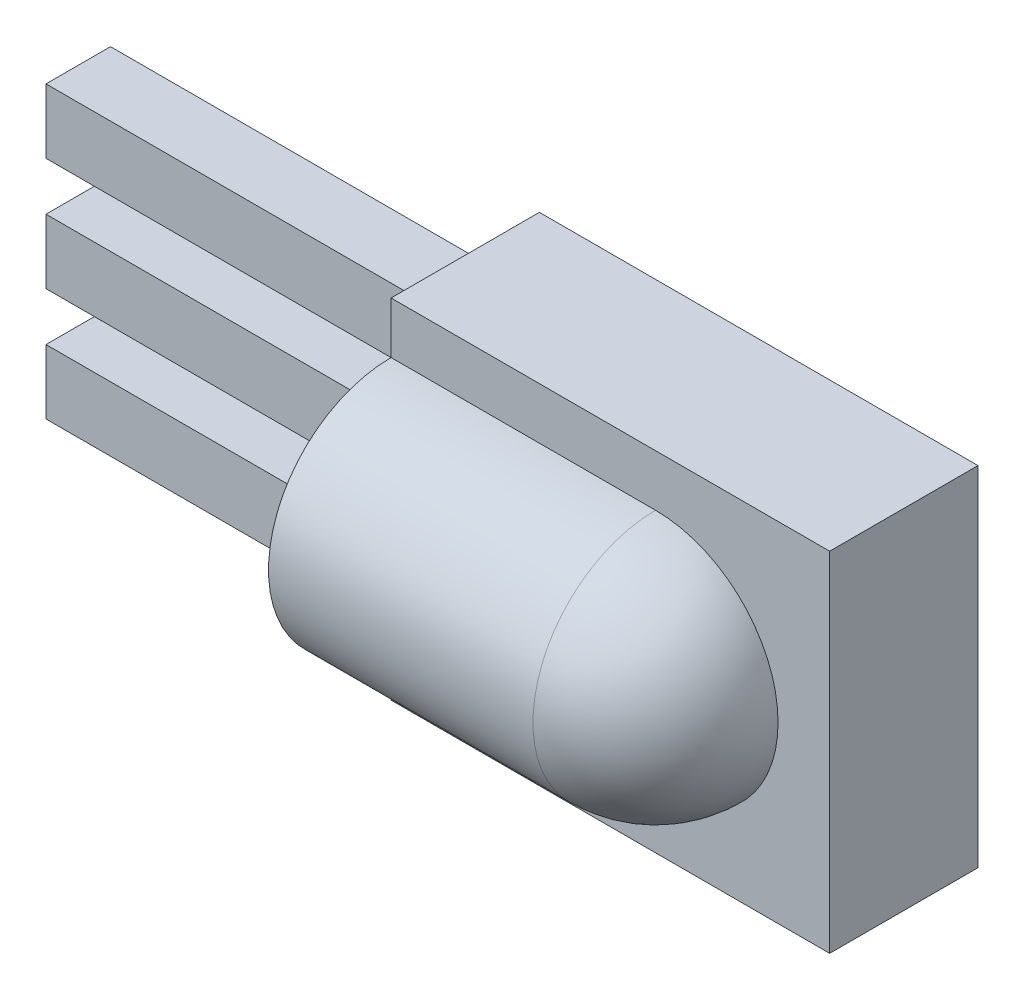
ISO-10303-21;
HEADER;
FILE_DESCRIPTION(('STEP AP214'),'2;1');
FILE_NAME('part.step','',(''),(''),'','','');
FILE_SCHEMA(('AUTOMOTIVE_DESIGN { 1 0 10303 214 1 1 1 1 }'));
ENDSEC;
DATA;
#1=APPLICATION_CONTEXT('core data for automotive mechanical design processes');
#2=APPLICATION_PROTOCOL_DEFINITION('international standard','automotive_design',2000,#1);
#3=PRODUCT_CONTEXT('',#1,'mechanical');
#4=PRODUCT('Part','Part','',(#3));
#5=PRODUCT_RELATED_PRODUCT_CATEGORY('part','',(#4));
#6=PRODUCT_DEFINITION_FORMATION('','',#4);
#7=PRODUCT_DEFINITION_CONTEXT('part definition',#1,'design');
#8=PRODUCT_DEFINITION('design','',#6,#7);
#9=PRODUCT_DEFINITION_SHAPE('','',#8);
#10=(LENGTH_UNIT() NAMED_UNIT(*) SI_UNIT(.MILLI.,.METRE.));
#11=(NAMED_UNIT(*) PLANE_ANGLE_UNIT() SI_UNIT($,.RADIAN.));
#12=(NAMED_UNIT(*) SI_UNIT($,.STERADIAN.) SOLID_ANGLE_UNIT());
#13=UNCERTAINTY_MEASURE_WITH_UNIT(LENGTH_MEASURE(1.E-05),#10,'distance_accuracy_value','');
#14=(GEOMETRIC_REPRESENTATION_CONTEXT(3) GLOBAL_UNCERTAINTY_ASSIGNED_CONTEXT((#13)) GLOBAL_UNIT_ASSIGNED_CONTEXT((#10,
#11,#12)) REPRESENTATION_CONTEXT('',''));
#15=CARTESIAN_POINT('',(0.,0.,0.));
#16=DIRECTION('',(0.,0.,1.));
#17=DIRECTION('',(1.,0.,0.));
#18=AXIS2_PLACEMENT_3D('',#15,#16,#17);
#19=CARTESIAN_POINT('',(0.,0.,2.3));
#20=DIRECTION('',(1.,0.,0.));
#21=DIRECTION('',(0.,0.,-1.));
#22=AXIS2_PLACEMENT_3D('',#19,#20,#21);
#23=PLANE('',#22);
#24=DIRECTION('',(0.,0.,-1.));
#25=VECTOR('',#24,1.);
#26=CARTESIAN_POINT('',(0.,4.95,1.64999999999999));
#27=LINE('',#26,#25);
#28=CARTESIAN_POINT('',(0.,4.95,1.64999999999999));
#29=VERTEX_POINT('',#28);
#30=CARTESIAN_POINT('',(0.,4.95,0.649999999999994));
#31=VERTEX_POINT('',#30);
#32=EDGE_CURVE('E182',#29,#31,#27,.T.);
#33=ORIENTED_EDGE('',*,*,#32,.F.);
#34=DIRECTION('',(0.,1.,0.));
#35=VECTOR('',#34,1.);
#36=CARTESIAN_POINT('',(0.,3.95,1.64999999999999));
#37=LINE('',#36,#35);
#38=CARTESIAN_POINT('',(0.,3.95,1.64999999999999));
#39=VERTEX_POINT('',#38);
#40=EDGE_CURVE('E195',#39,#29,#37,.T.);
#41=ORIENTED_EDGE('',*,*,#40,.F.);
#42=DIRECTION('',(0.,0.,1.));
#43=VECTOR('',#42,1.);
#44=CARTESIAN_POINT('',(0.,3.95,1.64999999999999));
#45=LINE('',#44,#43);
#46=CARTESIAN_POINT('',(0.,3.95,0.649999999999994));
#47=VERTEX_POINT('',#46);
#48=EDGE_CURVE('E204',#47,#39,#45,.T.);
#49=ORIENTED_EDGE('',*,*,#48,.F.);
#50=DIRECTION('',(0.,-1.,0.));
#51=VECTOR('',#50,1.);
#52=CARTESIAN_POINT('',(0.,3.95,0.649999999999994));
#53=LINE('',#52,#51);
#54=EDGE_CURVE('E185',#31,#47,#53,.T.);
#55=ORIENTED_EDGE('',*,*,#54,.F.);
#56=EDGE_LOOP('',(#33,#41,#49,#55));
#57=FACE_BOUND('',#56,.T.);
#58=DIRECTION('',(0.,-1.,0.));
#59=VECTOR('',#58,1.);
#60=CARTESIAN_POINT('',(0.,0.,2.3));
#61=LINE('',#60,#59);
#62=CARTESIAN_POINT('',(0.,0.800000000000001,2.3));
#63=VERTEX_POINT('',#62);
#64=CARTESIAN_POINT('',(0.,0.,2.3));
#65=VERTEX_POINT('',#64);
#66=EDGE_CURVE('E260',#63,#65,#61,.T.);
#67=ORIENTED_EDGE('',*,*,#66,.F.);
#68=CARTESIAN_POINT('',(0.,2.7,2.3));
#69=DIRECTION('',(-1.,0.,0.));
#70=DIRECTION('',(0.,0.,1.));
#71=AXIS2_PLACEMENT_3D('',#68,#69,#70);
#72=CIRCLE('',#71,1.9);
#73=CARTESIAN_POINT('',(0.,4.6,2.3));
#74=VERTEX_POINT('',#73);
#75=EDGE_CURVE('E253',#63,#74,#72,.T.);
#76=ORIENTED_EDGE('',*,*,#75,.T.);
#77=CARTESIAN_POINT('',(0.,5.4,2.3));
#78=VERTEX_POINT('',#77);
#79=EDGE_CURVE('E257',#78,#74,#61,.T.);
#80=ORIENTED_EDGE('',*,*,#79,.F.);
#81=DIRECTION('',(0.,0.,-1.));
#82=VECTOR('',#81,1.);
#83=CARTESIAN_POINT('',(0.,5.4,2.3));
#84=LINE('',#83,#82);
#85=CARTESIAN_POINT('',(0.,5.4,0.));
#86=VERTEX_POINT('',#85);
#87=EDGE_CURVE('E266',#78,#86,#84,.T.);
#88=ORIENTED_EDGE('',*,*,#87,.T.);
#89=DIRECTION('',(0.,-1.,0.));
#90=VECTOR('',#89,1.);
#91=CARTESIAN_POINT('',(0.,0.,0.));
#92=LINE('',#91,#90);
#93=CARTESIAN_POINT('',(0.,0.,0.));
#94=VERTEX_POINT('',#93);
#95=EDGE_CURVE('E256',#86,#94,#92,.T.);
#96=ORIENTED_EDGE('',*,*,#95,.T.);
#97=DIRECTION('',(0.,0.,-1.));
#98=VECTOR('',#97,1.);
#99=CARTESIAN_POINT('',(0.,0.,2.3));
#100=LINE('',#99,#98);
#101=EDGE_CURVE('E283',#65,#94,#100,.T.);
#102=ORIENTED_EDGE('',*,*,#101,.F.);
#103=EDGE_LOOP('',(#67,#76,#80,#88,#96,#102));
#104=FACE_BOUND('',#103,.T.);
#105=DIRECTION('',(0.,-1.,0.));
#106=VECTOR('',#105,1.);
#107=CARTESIAN_POINT('',(0.,2.2,0.65));
#108=LINE('',#107,#106);
#109=CARTESIAN_POINT('',(0.,3.2,0.65));
#110=VERTEX_POINT('',#109);
#111=CARTESIAN_POINT('',(0.,2.2,0.65));
#112=VERTEX_POINT('',#111);
#113=EDGE_CURVE('E220',#110,#112,#108,.T.);
#114=ORIENTED_EDGE('',*,*,#113,.F.);
#115=DIRECTION('',(0.,0.,-1.));
#116=VECTOR('',#115,1.);
#117=CARTESIAN_POINT('',(0.,3.2,1.65));
#118=LINE('',#117,#116);
#119=CARTESIAN_POINT('',(0.,3.2,1.65));
#120=VERTEX_POINT('',#119);
#121=EDGE_CURVE('E225',#120,#110,#118,.T.);
#122=ORIENTED_EDGE('',*,*,#121,.F.);
#123=DIRECTION('',(0.,1.,0.));
#124=VECTOR('',#123,1.);
#125=CARTESIAN_POINT('',(0.,2.2,1.65));
#126=LINE('',#125,#124);
#127=CARTESIAN_POINT('',(0.,2.2,1.65));
#128=VERTEX_POINT('',#127);
#129=EDGE_CURVE('E237',#128,#120,#126,.T.);
#130=ORIENTED_EDGE('',*,*,#129,.F.);
#131=DIRECTION('',(0.,0.,1.));
#132=VECTOR('',#131,1.);
#133=CARTESIAN_POINT('',(0.,2.2,1.65));
#134=LINE('',#133,#132);
#135=EDGE_CURVE('E234',#112,#128,#134,.T.);
#136=ORIENTED_EDGE('',*,*,#135,.F.);
#137=EDGE_LOOP('',(#114,#122,#130,#136));
#138=FACE_BOUND('',#137,.T.);
#139=DIRECTION('',(0.,0.,-1.));
#140=VECTOR('',#139,1.);
#141=CARTESIAN_POINT('',(0.,1.45,1.65000000000002));
#142=LINE('',#141,#140);
#143=CARTESIAN_POINT('',(0.,1.45,1.65000000000002));
#144=VERTEX_POINT('',#143);
#145=CARTESIAN_POINT('',(0.,1.45,0.650000000000018));
#146=VERTEX_POINT('',#145);
#147=EDGE_CURVE('E181',#144,#146,#142,.T.);
#148=ORIENTED_EDGE('',*,*,#147,.F.);
#149=DIRECTION('',(0.,1.,0.));
#150=VECTOR('',#149,1.);
#151=CARTESIAN_POINT('',(0.,0.450000000000001,1.65000000000002));
#152=LINE('',#151,#150);
#153=CARTESIAN_POINT('',(0.,0.450000000000001,1.65000000000002));
#154=VERTEX_POINT('',#153);
#155=EDGE_CURVE('E178',#154,#144,#152,.T.);
#156=ORIENTED_EDGE('',*,*,#155,.F.);
#157=DIRECTION('',(0.,0.,1.));
#158=VECTOR('',#157,1.);
#159=CARTESIAN_POINT('',(0.,0.450000000000001,1.65000000000002));
#160=LINE('',#159,#158);
#161=CARTESIAN_POINT('',(0.,0.450000000000001,0.650000000000018));
#162=VERTEX_POINT('',#161);
#163=EDGE_CURVE('E54',#162,#154,#160,.T.);
#164=ORIENTED_EDGE('',*,*,#163,.F.);
#165=DIRECTION('',(0.,-1.,0.));
#166=VECTOR('',#165,1.);
#167=CARTESIAN_POINT('',(0.,0.450000000000001,0.650000000000018));
#168=LINE('',#167,#166);
#169=EDGE_CURVE('E49',#146,#162,#168,.T.);
#170=ORIENTED_EDGE('',*,*,#169,.F.);
#171=EDGE_LOOP('',(#148,#156,#164,#170));
#172=FACE_BOUND('',#171,.T.);
#173=ADVANCED_FACE('F34',(#57,#104,#138,#172),#23,.F.);
#174=CARTESIAN_POINT('',(0.,0.,2.3));
#175=DIRECTION('',(0.,1.,0.));
#176=DIRECTION('',(0.,0.,1.));
#177=AXIS2_PLACEMENT_3D('',#174,#175,#176);
#178=PLANE('',#177);
#179=DIRECTION('',(1.,0.,0.));
#180=VECTOR('',#179,1.);
#181=CARTESIAN_POINT('',(0.,0.,0.));
#182=LINE('',#181,#180);
#183=CARTESIAN_POINT('',(6.8,0.,0.));
#184=VERTEX_POINT('',#183);
#185=EDGE_CURVE('E269',#94,#184,#182,.T.);
#186=ORIENTED_EDGE('',*,*,#185,.T.);
#187=DIRECTION('',(0.,0.,-1.));
#188=VECTOR('',#187,1.);
#189=CARTESIAN_POINT('',(6.8,0.,2.3));
#190=LINE('',#189,#188);
#191=CARTESIAN_POINT('',(6.8,0.,2.3));
#192=VERTEX_POINT('',#191);
#193=EDGE_CURVE('E280',#192,#184,#190,.T.);
#194=ORIENTED_EDGE('',*,*,#193,.F.);
#195=DIRECTION('',(1.,0.,0.));
#196=VECTOR('',#195,1.);
#197=CARTESIAN_POINT('',(0.,0.,2.3));
#198=LINE('',#197,#196);
#199=EDGE_CURVE('E259',#65,#192,#198,.T.);
#200=ORIENTED_EDGE('',*,*,#199,.F.);
#201=ORIENTED_EDGE('',*,*,#101,.T.);
#202=EDGE_LOOP('',(#186,#194,#200,#201));
#203=FACE_BOUND('',#202,.T.);
#204=ADVANCED_FACE('F311',(#203),#178,.F.);
#205=CARTESIAN_POINT('',(6.8,0.,2.3));
#206=DIRECTION('',(-1.,0.,0.));
#207=DIRECTION('',(0.,-1.,0.));
#208=AXIS2_PLACEMENT_3D('',#205,#206,#207);
#209=PLANE('',#208);
#210=DIRECTION('',(0.,1.,0.));
#211=VECTOR('',#210,1.);
#212=CARTESIAN_POINT('',(6.8,0.,0.));
#213=LINE('',#212,#211);
#214=CARTESIAN_POINT('',(6.8,5.4,0.));
#215=VERTEX_POINT('',#214);
#216=EDGE_CURVE('E271',#184,#215,#213,.T.);
#217=ORIENTED_EDGE('',*,*,#216,.T.);
#218=DIRECTION('',(0.,0.,-1.));
#219=VECTOR('',#218,1.);
#220=CARTESIAN_POINT('',(6.8,5.4,2.3));
#221=LINE('',#220,#219);
#222=CARTESIAN_POINT('',(6.8,5.4,2.3));
#223=VERTEX_POINT('',#222);
#224=EDGE_CURVE('E277',#223,#215,#221,.T.);
#225=ORIENTED_EDGE('',*,*,#224,.F.);
#226=DIRECTION('',(0.,1.,0.));
#227=VECTOR('',#226,1.);
#228=CARTESIAN_POINT('',(6.8,0.,2.3));
#229=LINE('',#228,#227);
#230=EDGE_CURVE('E262',#192,#223,#229,.T.);
#231=ORIENTED_EDGE('',*,*,#230,.F.);
#232=ORIENTED_EDGE('',*,*,#193,.T.);
#233=EDGE_LOOP('',(#217,#225,#231,#232));
#234=FACE_BOUND('',#233,.T.);
#235=ADVANCED_FACE('F318',(#234),#209,.F.);
#236=CARTESIAN_POINT('',(0.,5.4,2.3));
#237=DIRECTION('',(0.,-1.,0.));
#238=DIRECTION('',(0.,0.,-1.));
#239=AXIS2_PLACEMENT_3D('',#236,#237,#238);
#240=PLANE('',#239);
#241=DIRECTION('',(-1.,0.,0.));
#242=VECTOR('',#241,1.);
#243=CARTESIAN_POINT('',(0.,5.4,0.));
#244=LINE('',#243,#242);
#245=EDGE_CURVE('E273',#215,#86,#244,.T.);
#246=ORIENTED_EDGE('',*,*,#245,.T.);
#247=ORIENTED_EDGE('',*,*,#87,.F.);
#248=DIRECTION('',(-1.,0.,0.));
#249=VECTOR('',#248,1.);
#250=CARTESIAN_POINT('',(0.,5.4,2.3));
#251=LINE('',#250,#249);
#252=EDGE_CURVE('E264',#223,#78,#251,.T.);
#253=ORIENTED_EDGE('',*,*,#252,.F.);
#254=ORIENTED_EDGE('',*,*,#224,.T.);
#255=EDGE_LOOP('',(#246,#247,#253,#254));
#256=FACE_BOUND('',#255,.T.);
#257=ADVANCED_FACE('F322',(#256),#240,.F.);
#258=CARTESIAN_POINT('',(0.,0.,2.3));
#259=DIRECTION('',(0.,0.,-1.));
#260=DIRECTION('',(-1.,0.,0.));
#261=AXIS2_PLACEMENT_3D('',#258,#259,#260);
#262=PLANE('',#261);
#263=CARTESIAN_POINT('',(4.1,2.7,2.3));
#264=DIRECTION('',(0.,0.,-1.));
#265=DIRECTION('',(-1.,0.,0.));
#266=AXIS2_PLACEMENT_3D('',#263,#264,#265);
#267=CIRCLE('',#266,1.9);
#268=CARTESIAN_POINT('',(4.1,4.6,2.3));
#269=VERTEX_POINT('',#268);
#270=CARTESIAN_POINT('',(6.,2.7,2.3));
#271=VERTEX_POINT('',#270);
#272=EDGE_CURVE('E42',#269,#271,#267,.T.);
#273=ORIENTED_EDGE('',*,*,#272,.T.);
#274=CARTESIAN_POINT('',(4.1,2.7,2.3));
#275=DIRECTION('',(0.,0.,-1.));
#276=DIRECTION('',(-1.,0.,0.));
#277=AXIS2_PLACEMENT_3D('',#274,#275,#276);
#278=CIRCLE('',#277,1.9);
#279=CARTESIAN_POINT('',(4.1,0.800000000000001,2.3));
#280=VERTEX_POINT('',#279);
#281=EDGE_CURVE('E11',#271,#280,#278,.T.);
#282=ORIENTED_EDGE('',*,*,#281,.T.);
#283=DIRECTION('',(-1.,0.,0.));
#284=VECTOR('',#283,1.);
#285=CARTESIAN_POINT('',(6.,0.800000000000001,2.3));
#286=LINE('',#285,#284);
#287=EDGE_CURVE('E289',#280,#63,#286,.T.);
#288=ORIENTED_EDGE('',*,*,#287,.T.);
#289=ORIENTED_EDGE('',*,*,#66,.T.);
#290=ORIENTED_EDGE('',*,*,#199,.T.);
#291=ORIENTED_EDGE('',*,*,#230,.T.);
#292=ORIENTED_EDGE('',*,*,#252,.T.);
#293=ORIENTED_EDGE('',*,*,#79,.T.);
#294=DIRECTION('',(-1.,0.,0.));
#295=VECTOR('',#294,1.);
#296=CARTESIAN_POINT('',(6.,4.6,2.3));
#297=LINE('',#296,#295);
#298=EDGE_CURVE('E286',#74,#269,#297,.F.);
#299=ORIENTED_EDGE('',*,*,#298,.T.);
#300=EDGE_LOOP('',(#273,#282,#288,#289,#290,#291,#292,#293,#299));
#301=FACE_BOUND('',#300,.T.);
#302=ADVANCED_FACE('F295',(#301),#262,.F.);
#303=CARTESIAN_POINT('',(0.,0.,0.));
#304=DIRECTION('',(0.,0.,-1.));
#305=DIRECTION('',(-1.,0.,0.));
#306=AXIS2_PLACEMENT_3D('',#303,#304,#305);
#307=PLANE('',#306);
#308=ORIENTED_EDGE('',*,*,#95,.F.);
#309=ORIENTED_EDGE('',*,*,#245,.F.);
#310=ORIENTED_EDGE('',*,*,#216,.F.);
#311=ORIENTED_EDGE('',*,*,#185,.F.);
#312=EDGE_LOOP('',(#308,#309,#310,#311));
#313=FACE_BOUND('',#312,.T.);
#314=ADVANCED_FACE('F324',(#313),#307,.T.);
#315=CARTESIAN_POINT('',(6.,2.7,2.3));
#316=DIRECTION('',(-1.,0.,0.));
#317=DIRECTION('',(0.,0.,1.));
#318=AXIS2_PLACEMENT_3D('',#315,#316,#317);
#319=CYLINDRICAL_SURFACE('',#318,1.9);
#320=ORIENTED_EDGE('',*,*,#287,.F.);
#321=CARTESIAN_POINT('',(4.1,2.7,2.3));
#322=DIRECTION('',(-1.,0.,0.));
#323=DIRECTION('',(0.,0.,1.));
#324=AXIS2_PLACEMENT_3D('',#321,#322,#323);
#325=CIRCLE('',#324,1.9);
#326=EDGE_CURVE('E291',#280,#269,#325,.T.);
#327=ORIENTED_EDGE('',*,*,#326,.T.);
#328=ORIENTED_EDGE('',*,*,#298,.F.);
#329=ORIENTED_EDGE('',*,*,#75,.F.);
#330=EDGE_LOOP('',(#320,#327,#328,#329));
#331=FACE_BOUND('',#330,.T.);
#332=ADVANCED_FACE('F301',(#331),#319,.T.);
#333=CARTESIAN_POINT('',(4.1,2.7,2.3));
#334=DIRECTION('',(-1.,0.,0.));
#335=DIRECTION('',(0.,0.,1.));
#336=AXIS2_PLACEMENT_3D('',#333,#334,#335);
#337=SPHERICAL_SURFACE('',#336,1.9);
#338=ORIENTED_EDGE('',*,*,#326,.F.);
#339=ORIENTED_EDGE('',*,*,#281,.F.);
#340=ORIENTED_EDGE('',*,*,#272,.F.);
#341=EDGE_LOOP('',(#338,#339,#340));
#342=FACE_BOUND('',#341,.T.);
#343=ADVANCED_FACE('F36',(#342),#337,.T.);
#344=CARTESIAN_POINT('',(-6.,2.2,0.65));
#345=DIRECTION('',(0.,0.,1.));
#346=DIRECTION('',(1.,0.,0.));
#347=AXIS2_PLACEMENT_3D('',#344,#345,#346);
#348=PLANE('',#347);
#349=ORIENTED_EDGE('',*,*,#113,.T.);
#350=DIRECTION('',(1.,0.,0.));
#351=VECTOR('',#350,1.);
#352=CARTESIAN_POINT('',(-6.,2.2,0.65));
#353=LINE('',#352,#351);
#354=CARTESIAN_POINT('',(-6.,2.2,0.65));
#355=VERTEX_POINT('',#354);
#356=EDGE_CURVE('E250',#355,#112,#353,.T.);
#357=ORIENTED_EDGE('',*,*,#356,.F.);
#358=DIRECTION('',(0.,-1.,0.));
#359=VECTOR('',#358,1.);
#360=CARTESIAN_POINT('',(-6.,2.2,0.65));
#361=LINE('',#360,#359);
#362=CARTESIAN_POINT('',(-6.,3.2,0.65));
#363=VERTEX_POINT('',#362);
#364=EDGE_CURVE('E221',#363,#355,#361,.T.);
#365=ORIENTED_EDGE('',*,*,#364,.F.);
#366=DIRECTION('',(1.,0.,0.));
#367=VECTOR('',#366,1.);
#368=CARTESIAN_POINT('',(-6.,3.2,0.65));
#369=LINE('',#368,#367);
#370=EDGE_CURVE('E231',#363,#110,#369,.T.);
#371=ORIENTED_EDGE('',*,*,#370,.T.);
#372=EDGE_LOOP('',(#349,#357,#365,#371));
#373=FACE_BOUND('',#372,.T.);
#374=ADVANCED_FACE('F367',(#373),#348,.F.);
#375=CARTESIAN_POINT('',(-6.,2.2,1.65));
#376=DIRECTION('',(0.,1.,0.));
#377=DIRECTION('',(0.,0.,1.));
#378=AXIS2_PLACEMENT_3D('',#375,#376,#377);
#379=PLANE('',#378);
#380=ORIENTED_EDGE('',*,*,#135,.T.);
#381=DIRECTION('',(1.,0.,0.));
#382=VECTOR('',#381,1.);
#383=CARTESIAN_POINT('',(-6.,2.2,1.65));
#384=LINE('',#383,#382);
#385=CARTESIAN_POINT('',(-6.,2.2,1.65));
#386=VERTEX_POINT('',#385);
#387=EDGE_CURVE('E247',#386,#128,#384,.T.);
#388=ORIENTED_EDGE('',*,*,#387,.F.);
#389=DIRECTION('',(0.,0.,1.));
#390=VECTOR('',#389,1.);
#391=CARTESIAN_POINT('',(-6.,2.2,1.65));
#392=LINE('',#391,#390);
#393=EDGE_CURVE('E224',#355,#386,#392,.T.);
#394=ORIENTED_EDGE('',*,*,#393,.F.);
#395=ORIENTED_EDGE('',*,*,#356,.T.);
#396=EDGE_LOOP('',(#380,#388,#394,#395));
#397=FACE_BOUND('',#396,.T.);
#398=ADVANCED_FACE('F381',(#397),#379,.F.);
#399=CARTESIAN_POINT('',(-6.,2.2,1.65));
#400=DIRECTION('',(0.,0.,-1.));
#401=DIRECTION('',(-1.,0.,0.));
#402=AXIS2_PLACEMENT_3D('',#399,#400,#401);
#403=PLANE('',#402);
#404=ORIENTED_EDGE('',*,*,#129,.T.);
#405=DIRECTION('',(1.,0.,0.));
#406=VECTOR('',#405,1.);
#407=CARTESIAN_POINT('',(-6.,3.2,1.65));
#408=LINE('',#407,#406);
#409=CARTESIAN_POINT('',(-6.,3.2,1.65));
#410=VERTEX_POINT('',#409);
#411=EDGE_CURVE('E244',#410,#120,#408,.T.);
#412=ORIENTED_EDGE('',*,*,#411,.F.);
#413=DIRECTION('',(0.,1.,0.));
#414=VECTOR('',#413,1.);
#415=CARTESIAN_POINT('',(-6.,2.2,1.65));
#416=LINE('',#415,#414);
#417=EDGE_CURVE('E227',#386,#410,#416,.T.);
#418=ORIENTED_EDGE('',*,*,#417,.F.);
#419=ORIENTED_EDGE('',*,*,#387,.T.);
#420=EDGE_LOOP('',(#404,#412,#418,#419));
#421=FACE_BOUND('',#420,.T.);
#422=ADVANCED_FACE('F391',(#421),#403,.F.);
#423=CARTESIAN_POINT('',(-6.,3.2,1.65));
#424=DIRECTION('',(0.,-1.,0.));
#425=DIRECTION('',(0.,0.,-1.));
#426=AXIS2_PLACEMENT_3D('',#423,#424,#425);
#427=PLANE('',#426);
#428=ORIENTED_EDGE('',*,*,#121,.T.);
#429=ORIENTED_EDGE('',*,*,#370,.F.);
#430=DIRECTION('',(0.,0.,-1.));
#431=VECTOR('',#430,1.);
#432=CARTESIAN_POINT('',(-6.,3.2,1.65));
#433=LINE('',#432,#431);
#434=EDGE_CURVE('E229',#410,#363,#433,.T.);
#435=ORIENTED_EDGE('',*,*,#434,.F.);
#436=ORIENTED_EDGE('',*,*,#411,.T.);
#437=EDGE_LOOP('',(#428,#429,#435,#436));
#438=FACE_BOUND('',#437,.T.);
#439=ADVANCED_FACE('F401',(#438),#427,.F.);
#440=CARTESIAN_POINT('',(-6.,0.,0.));
#441=DIRECTION('',(-1.,0.,0.));
#442=DIRECTION('',(0.,0.,1.));
#443=AXIS2_PLACEMENT_3D('',#440,#441,#442);
#444=PLANE('',#443);
#445=ORIENTED_EDGE('',*,*,#364,.T.);
#446=ORIENTED_EDGE('',*,*,#393,.T.);
#447=ORIENTED_EDGE('',*,*,#417,.T.);
#448=ORIENTED_EDGE('',*,*,#434,.T.);
#449=EDGE_LOOP('',(#445,#446,#447,#448));
#450=FACE_BOUND('',#449,.T.);
#451=ADVANCED_FACE('F411',(#450),#444,.T.);
#452=CARTESIAN_POINT('',(-6.,4.95,1.64999999999999));
#453=DIRECTION('',(0.,-1.,0.));
#454=DIRECTION('',(0.,0.,-1.));
#455=AXIS2_PLACEMENT_3D('',#452,#453,#454);
#456=PLANE('',#455);
#457=ORIENTED_EDGE('',*,*,#32,.T.);
#458=DIRECTION('',(1.,0.,0.));
#459=VECTOR('',#458,1.);
#460=CARTESIAN_POINT('',(-6.,4.95,0.649999999999994));
#461=LINE('',#460,#459);
#462=CARTESIAN_POINT('',(-6.,4.95,0.649999999999994));
#463=VERTEX_POINT('',#462);
#464=EDGE_CURVE('E217',#463,#31,#461,.T.);
#465=ORIENTED_EDGE('',*,*,#464,.F.);
#466=DIRECTION('',(0.,0.,-1.));
#467=VECTOR('',#466,1.);
#468=CARTESIAN_POINT('',(-6.,4.95,1.64999999999999));
#469=LINE('',#468,#467);
#470=CARTESIAN_POINT('',(-6.,4.95,1.64999999999999));
#471=VERTEX_POINT('',#470);
#472=EDGE_CURVE('E191',#471,#463,#469,.T.);
#473=ORIENTED_EDGE('',*,*,#472,.F.);
#474=DIRECTION('',(1.,0.,0.));
#475=VECTOR('',#474,1.);
#476=CARTESIAN_POINT('',(-6.,4.95,1.64999999999999));
#477=LINE('',#476,#475);
#478=EDGE_CURVE('E200',#471,#29,#477,.T.);
#479=ORIENTED_EDGE('',*,*,#478,.T.);
#480=EDGE_LOOP('',(#457,#465,#473,#479));
#481=FACE_BOUND('',#480,.T.);
#482=ADVANCED_FACE('F421',(#481),#456,.F.);
#483=CARTESIAN_POINT('',(-6.,3.95,0.649999999999994));
#484=DIRECTION('',(0.,0.,1.));
#485=DIRECTION('',(1.,0.,0.));
#486=AXIS2_PLACEMENT_3D('',#483,#484,#485);
#487=PLANE('',#486);
#488=ORIENTED_EDGE('',*,*,#54,.T.);
#489=DIRECTION('',(1.,0.,0.));
#490=VECTOR('',#489,1.);
#491=CARTESIAN_POINT('',(-6.,3.95,0.649999999999994));
#492=LINE('',#491,#490);
#493=CARTESIAN_POINT('',(-6.,3.95,0.649999999999994));
#494=VERTEX_POINT('',#493);
#495=EDGE_CURVE('E214',#494,#47,#492,.T.);
#496=ORIENTED_EDGE('',*,*,#495,.F.);
#497=DIRECTION('',(0.,-1.,0.));
#498=VECTOR('',#497,1.);
#499=CARTESIAN_POINT('',(-6.,3.95,0.649999999999994));
#500=LINE('',#499,#498);
#501=EDGE_CURVE('E194',#463,#494,#500,.T.);
#502=ORIENTED_EDGE('',*,*,#501,.F.);
#503=ORIENTED_EDGE('',*,*,#464,.T.);
#504=EDGE_LOOP('',(#488,#496,#502,#503));
#505=FACE_BOUND('',#504,.T.);
#506=ADVANCED_FACE('F431',(#505),#487,.F.);
#507=CARTESIAN_POINT('',(-6.,3.95,1.64999999999999));
#508=DIRECTION('',(0.,1.,0.));
#509=DIRECTION('',(0.,0.,1.));
#510=AXIS2_PLACEMENT_3D('',#507,#508,#509);
#511=PLANE('',#510);
#512=ORIENTED_EDGE('',*,*,#48,.T.);
#513=DIRECTION('',(1.,0.,0.));
#514=VECTOR('',#513,1.);
#515=CARTESIAN_POINT('',(-6.,3.95,1.64999999999999));
#516=LINE('',#515,#514);
#517=CARTESIAN_POINT('',(-6.,3.95,1.64999999999999));
#518=VERTEX_POINT('',#517);
#519=EDGE_CURVE('E211',#518,#39,#516,.T.);
#520=ORIENTED_EDGE('',*,*,#519,.F.);
#521=DIRECTION('',(0.,0.,1.));
#522=VECTOR('',#521,1.);
#523=CARTESIAN_POINT('',(-6.,3.95,1.64999999999999));
#524=LINE('',#523,#522);
#525=EDGE_CURVE('E197',#494,#518,#524,.T.);
#526=ORIENTED_EDGE('',*,*,#525,.F.);
#527=ORIENTED_EDGE('',*,*,#495,.T.);
#528=EDGE_LOOP('',(#512,#520,#526,#527));
#529=FACE_BOUND('',#528,.T.);
#530=ADVANCED_FACE('F441',(#529),#511,.F.);
#531=CARTESIAN_POINT('',(-6.,3.95,1.64999999999999));
#532=DIRECTION('',(0.,0.,-1.));
#533=DIRECTION('',(-1.,0.,0.));
#534=AXIS2_PLACEMENT_3D('',#531,#532,#533);
#535=PLANE('',#534);
#536=ORIENTED_EDGE('',*,*,#40,.T.);
#537=ORIENTED_EDGE('',*,*,#478,.F.);
#538=DIRECTION('',(0.,1.,0.));
#539=VECTOR('',#538,1.);
#540=CARTESIAN_POINT('',(-6.,3.95,1.64999999999999));
#541=LINE('',#540,#539);
#542=EDGE_CURVE('E199',#518,#471,#541,.T.);
#543=ORIENTED_EDGE('',*,*,#542,.F.);
#544=ORIENTED_EDGE('',*,*,#519,.T.);
#545=EDGE_LOOP('',(#536,#537,#543,#544));
#546=FACE_BOUND('',#545,.T.);
#547=ADVANCED_FACE('F451',(#546),#535,.F.);
#548=CARTESIAN_POINT('',(-6.,0.,0.));
#549=DIRECTION('',(1.,0.,0.));
#550=DIRECTION('',(0.,0.,-1.));
#551=AXIS2_PLACEMENT_3D('',#548,#549,#550);
#552=PLANE('',#551);
#553=ORIENTED_EDGE('',*,*,#472,.T.);
#554=ORIENTED_EDGE('',*,*,#501,.T.);
#555=ORIENTED_EDGE('',*,*,#525,.T.);
#556=ORIENTED_EDGE('',*,*,#542,.T.);
#557=EDGE_LOOP('',(#553,#554,#555,#556));
#558=FACE_BOUND('',#557,.T.);
#559=ADVANCED_FACE('F461',(#558),#552,.F.);
#560=CARTESIAN_POINT('',(-6.,1.45,1.65000000000002));
#561=DIRECTION('',(0.,-1.,0.));
#562=DIRECTION('',(0.,0.,-1.));
#563=AXIS2_PLACEMENT_3D('',#560,#561,#562);
#564=PLANE('',#563);
#565=ORIENTED_EDGE('',*,*,#147,.T.);
#566=DIRECTION('',(1.,0.,0.));
#567=VECTOR('',#566,1.);
#568=CARTESIAN_POINT('',(-6.,1.45,0.650000000000018));
#569=LINE('',#568,#567);
#570=CARTESIAN_POINT('',(-6.,1.45,0.650000000000018));
#571=VERTEX_POINT('',#570);
#572=EDGE_CURVE('E162',#571,#146,#569,.T.);
#573=ORIENTED_EDGE('',*,*,#572,.F.);
#574=DIRECTION('',(0.,0.,-1.));
#575=VECTOR('',#574,1.);
#576=CARTESIAN_POINT('',(-6.,1.45,1.65000000000002));
#577=LINE('',#576,#575);
#578=CARTESIAN_POINT('',(-6.,1.45,1.65000000000002));
#579=VERTEX_POINT('',#578);
#580=EDGE_CURVE('E169',#579,#571,#577,.T.);
#581=ORIENTED_EDGE('',*,*,#580,.F.);
#582=DIRECTION('',(1.,0.,0.));
#583=VECTOR('',#582,1.);
#584=CARTESIAN_POINT('',(-6.,1.45,1.65000000000002));
#585=LINE('',#584,#583);
#586=EDGE_CURVE('E521',#579,#144,#585,.T.);
#587=ORIENTED_EDGE('',*,*,#586,.T.);
#588=EDGE_LOOP('',(#565,#573,#581,#587));
#589=FACE_BOUND('',#588,.T.);
#590=ADVANCED_FACE('F180',(#589),#564,.F.);
#591=CARTESIAN_POINT('',(-6.,0.450000000000001,0.650000000000018));
#592=DIRECTION('',(0.,0.,1.));
#593=DIRECTION('',(1.,0.,0.));
#594=AXIS2_PLACEMENT_3D('',#591,#592,#593);
#595=PLANE('',#594);
#596=ORIENTED_EDGE('',*,*,#169,.T.);
#597=DIRECTION('',(1.,0.,0.));
#598=VECTOR('',#597,1.);
#599=CARTESIAN_POINT('',(-6.,0.450000000000001,0.650000000000018));
#600=LINE('',#599,#598);
#601=CARTESIAN_POINT('',(-6.,0.450000000000001,0.650000000000018));
#602=VERTEX_POINT('',#601);
#603=EDGE_CURVE('E165',#602,#162,#600,.T.);
#604=ORIENTED_EDGE('',*,*,#603,.F.);
#605=DIRECTION('',(0.,-1.,0.));
#606=VECTOR('',#605,1.);
#607=CARTESIAN_POINT('',(-6.,0.450000000000001,0.650000000000018));
#608=LINE('',#607,#606);
#609=EDGE_CURVE('E158',#571,#602,#608,.T.);
#610=ORIENTED_EDGE('',*,*,#609,.F.);
#611=ORIENTED_EDGE('',*,*,#572,.T.);
#612=EDGE_LOOP('',(#596,#604,#610,#611));
#613=FACE_BOUND('',#612,.T.);
#614=ADVANCED_FACE('F160',(#613),#595,.F.);
#615=CARTESIAN_POINT('',(-6.,0.450000000000001,1.65000000000002));
#616=DIRECTION('',(0.,1.,0.));
#617=DIRECTION('',(0.,0.,1.));
#618=AXIS2_PLACEMENT_3D('',#615,#616,#617);
#619=PLANE('',#618);
#620=ORIENTED_EDGE('',*,*,#163,.T.);
#621=DIRECTION('',(1.,0.,0.));
#622=VECTOR('',#621,1.);
#623=CARTESIAN_POINT('',(-6.,0.450000000000001,1.65000000000002));
#624=LINE('',#623,#622);
#625=CARTESIAN_POINT('',(-6.,0.450000000000001,1.65000000000002));
#626=VERTEX_POINT('',#625);
#627=EDGE_CURVE('E187',#626,#154,#624,.T.);
#628=ORIENTED_EDGE('',*,*,#627,.F.);
#629=DIRECTION('',(0.,0.,1.));
#630=VECTOR('',#629,1.);
#631=CARTESIAN_POINT('',(-6.,0.450000000000001,1.65000000000002));
#632=LINE('',#631,#630);
#633=EDGE_CURVE('E168',#602,#626,#632,.T.);
#634=ORIENTED_EDGE('',*,*,#633,.F.);
#635=ORIENTED_EDGE('',*,*,#603,.T.);
#636=EDGE_LOOP('',(#620,#628,#634,#635));
#637=FACE_BOUND('',#636,.T.);
#638=ADVANCED_FACE('F488',(#637),#619,.F.);
#639=CARTESIAN_POINT('',(-6.,0.450000000000001,1.65000000000002));
#640=DIRECTION('',(0.,0.,-1.));
#641=DIRECTION('',(-1.,0.,0.));
#642=AXIS2_PLACEMENT_3D('',#639,#640,#641);
#643=PLANE('',#642);
#644=ORIENTED_EDGE('',*,*,#155,.T.);
#645=ORIENTED_EDGE('',*,*,#586,.F.);
#646=DIRECTION('',(0.,1.,0.));
#647=VECTOR('',#646,1.);
#648=CARTESIAN_POINT('',(-6.,0.450000000000001,1.65000000000002));
#649=LINE('',#648,#647);
#650=EDGE_CURVE('E174',#626,#579,#649,.T.);
#651=ORIENTED_EDGE('',*,*,#650,.F.);
#652=ORIENTED_EDGE('',*,*,#627,.T.);
#653=EDGE_LOOP('',(#644,#645,#651,#652));
#654=FACE_BOUND('',#653,.T.);
#655=ADVANCED_FACE('F497',(#654),#643,.F.);
#656=CARTESIAN_POINT('',(-6.,0.,0.));
#657=DIRECTION('',(1.,0.,0.));
#658=DIRECTION('',(0.,0.,-1.));
#659=AXIS2_PLACEMENT_3D('',#656,#657,#658);
#660=PLANE('',#659);
#661=ORIENTED_EDGE('',*,*,#580,.T.);
#662=ORIENTED_EDGE('',*,*,#609,.T.);
#663=ORIENTED_EDGE('',*,*,#633,.T.);
#664=ORIENTED_EDGE('',*,*,#650,.T.);
#665=EDGE_LOOP('',(#661,#662,#663,#664));
#666=FACE_BOUND('',#665,.T.);
#667=ADVANCED_FACE('F172',(#666),#660,.F.);
#668=CLOSED_SHELL('',(#173,#204,#235,#257,#302,#314,#332,#343,#374,#398,#422,#439,#451,#482,
#506,#530,#547,#559,#590,#614,#638,#655,#667));
#669=MANIFOLD_SOLID_BREP('B2',#668);
#670=ADVANCED_BREP_SHAPE_REPRESENTATION('',(#18,#669),#14);
#671=SHAPE_DEFINITION_REPRESENTATION(#9,#670);
ENDSEC;
END-ISO-10303-21;
